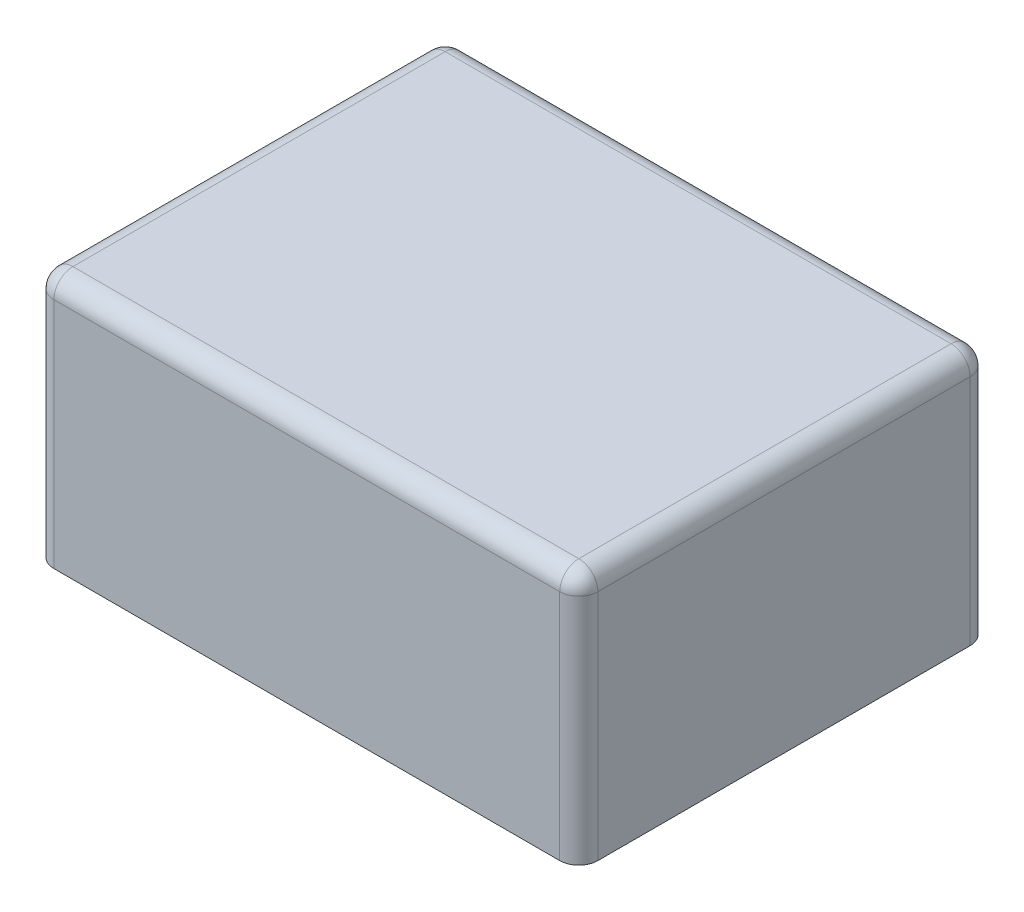
ISO-10303-21;
HEADER;
FILE_DESCRIPTION(('STEP AP214'),'2;1');
FILE_NAME('part.step','',(''),(''),'','','');
FILE_SCHEMA(('AUTOMOTIVE_DESIGN { 1 0 10303 214 1 1 1 1 }'));
ENDSEC;
DATA;
#1=APPLICATION_CONTEXT('core data for automotive mechanical design processes');
#2=APPLICATION_PROTOCOL_DEFINITION('international standard','automotive_design',2000,#1);
#3=PRODUCT_CONTEXT('',#1,'mechanical');
#4=PRODUCT('Part','Part','',(#3));
#5=PRODUCT_RELATED_PRODUCT_CATEGORY('part','',(#4));
#6=PRODUCT_DEFINITION_FORMATION('','',#4);
#7=PRODUCT_DEFINITION_CONTEXT('part definition',#1,'design');
#8=PRODUCT_DEFINITION('design','',#6,#7);
#9=PRODUCT_DEFINITION_SHAPE('','',#8);
#10=(LENGTH_UNIT() NAMED_UNIT(*) SI_UNIT(.MILLI.,.METRE.));
#11=(NAMED_UNIT(*) PLANE_ANGLE_UNIT() SI_UNIT($,.RADIAN.));
#12=(NAMED_UNIT(*) SI_UNIT($,.STERADIAN.) SOLID_ANGLE_UNIT());
#13=UNCERTAINTY_MEASURE_WITH_UNIT(LENGTH_MEASURE(1.E-05),#10,'distance_accuracy_value','');
#14=(GEOMETRIC_REPRESENTATION_CONTEXT(3) GLOBAL_UNCERTAINTY_ASSIGNED_CONTEXT((#13)) GLOBAL_UNIT_ASSIGNED_CONTEXT((#10,
#11,#12)) REPRESENTATION_CONTEXT('',''));
#15=CARTESIAN_POINT('',(0.,0.,0.));
#16=DIRECTION('',(0.,0.,1.));
#17=DIRECTION('',(1.,0.,0.));
#18=AXIS2_PLACEMENT_3D('',#15,#16,#17);
#19=CARTESIAN_POINT('',(1.,13.2,-1.));
#20=DIRECTION('',(0.,-1.,0.));
#21=DIRECTION('',(0.,0.,-1.));
#22=AXIS2_PLACEMENT_3D('',#19,#20,#21);
#23=CYLINDRICAL_SURFACE('',#22,1.);
#24=DIRECTION('',(0.,-1.,0.));
#25=VECTOR('',#24,1.);
#26=CARTESIAN_POINT('',(1.00000000000001,13.2,0.));
#27=LINE('',#26,#25);
#28=CARTESIAN_POINT('',(1.00000000000001,12.2,0.));
#29=VERTEX_POINT('',#28);
#30=CARTESIAN_POINT('',(1.00000000000001,0.,0.));
#31=VERTEX_POINT('',#30);
#32=EDGE_CURVE('E120',#29,#31,#27,.T.);
#33=ORIENTED_EDGE('',*,*,#32,.F.);
#34=CARTESIAN_POINT('',(1.,12.2,-1.));
#35=DIRECTION('',(0.,-1.,0.));
#36=DIRECTION('',(0.,0.,-1.));
#37=AXIS2_PLACEMENT_3D('',#34,#35,#36);
#38=CIRCLE('',#37,1.);
#39=CARTESIAN_POINT('',(0.,12.2,-1.00000000000001));
#40=VERTEX_POINT('',#39);
#41=EDGE_CURVE('E132',#29,#40,#38,.T.);
#42=ORIENTED_EDGE('',*,*,#41,.T.);
#43=DIRECTION('',(0.,-1.,0.));
#44=VECTOR('',#43,1.);
#45=CARTESIAN_POINT('',(0.,13.2,-1.00000000000001));
#46=LINE('',#45,#44);
#47=CARTESIAN_POINT('',(0.,0.,-1.00000000000001));
#48=VERTEX_POINT('',#47);
#49=EDGE_CURVE('E146',#40,#48,#46,.T.);
#50=ORIENTED_EDGE('',*,*,#49,.T.);
#51=CARTESIAN_POINT('',(1.,0.,-1.));
#52=DIRECTION('',(0.,1.,0.));
#53=DIRECTION('',(0.,0.,-1.));
#54=AXIS2_PLACEMENT_3D('',#51,#52,#53);
#55=CIRCLE('',#54,1.);
#56=EDGE_CURVE('E139',#48,#31,#55,.T.);
#57=ORIENTED_EDGE('',*,*,#56,.T.);
#58=EDGE_LOOP('',(#33,#42,#50,#57));
#59=FACE_BOUND('',#58,.T.);
#60=ADVANCED_FACE('F41',(#59),#23,.T.);
#61=CARTESIAN_POINT('',(1.00000000000001,13.2,0.));
#62=DIRECTION('',(0.,0.,-1.));
#63=DIRECTION('',(-1.,0.,0.));
#64=AXIS2_PLACEMENT_3D('',#61,#62,#63);
#65=PLANE('',#64);
#66=DIRECTION('',(0.,-1.,0.));
#67=VECTOR('',#66,1.);
#68=CARTESIAN_POINT('',(27.5,13.2,0.));
#69=LINE('',#68,#67);
#70=CARTESIAN_POINT('',(27.5,12.2,0.));
#71=VERTEX_POINT('',#70);
#72=CARTESIAN_POINT('',(27.5,0.,0.));
#73=VERTEX_POINT('',#72);
#74=EDGE_CURVE('E133',#71,#73,#69,.T.);
#75=ORIENTED_EDGE('',*,*,#74,.F.);
#76=DIRECTION('',(1.,0.,0.));
#77=VECTOR('',#76,1.);
#78=CARTESIAN_POINT('',(1.00000000000001,12.2,0.));
#79=LINE('',#78,#77);
#80=EDGE_CURVE('E11',#71,#29,#79,.F.);
#81=ORIENTED_EDGE('',*,*,#80,.T.);
#82=ORIENTED_EDGE('',*,*,#32,.T.);
#83=DIRECTION('',(1.,0.,0.));
#84=VECTOR('',#83,1.);
#85=CARTESIAN_POINT('',(1.00000000000001,0.,0.));
#86=LINE('',#85,#84);
#87=EDGE_CURVE('E124',#31,#73,#86,.T.);
#88=ORIENTED_EDGE('',*,*,#87,.T.);
#89=EDGE_LOOP('',(#75,#81,#82,#88));
#90=FACE_BOUND('',#89,.T.);
#91=ADVANCED_FACE('F123',(#90),#65,.F.);
#92=CARTESIAN_POINT('',(27.5,13.2,-1.));
#93=DIRECTION('',(0.,-1.,0.));
#94=DIRECTION('',(0.,0.,-1.));
#95=AXIS2_PLACEMENT_3D('',#92,#93,#94);
#96=CYLINDRICAL_SURFACE('',#95,1.);
#97=DIRECTION('',(0.,-1.,0.));
#98=VECTOR('',#97,1.);
#99=CARTESIAN_POINT('',(28.5,13.2,-1.00000000000001));
#100=LINE('',#99,#98);
#101=CARTESIAN_POINT('',(28.5,12.2,-1.00000000000001));
#102=VERTEX_POINT('',#101);
#103=CARTESIAN_POINT('',(28.5,0.,-1.00000000000001));
#104=VERTEX_POINT('',#103);
#105=EDGE_CURVE('E189',#102,#104,#100,.T.);
#106=ORIENTED_EDGE('',*,*,#105,.F.);
#107=CARTESIAN_POINT('',(27.5,12.2,-1.));
#108=DIRECTION('',(0.,-1.,0.));
#109=DIRECTION('',(0.,0.,-1.));
#110=AXIS2_PLACEMENT_3D('',#107,#108,#109);
#111=CIRCLE('',#110,1.);
#112=EDGE_CURVE('E202',#102,#71,#111,.T.);
#113=ORIENTED_EDGE('',*,*,#112,.T.);
#114=ORIENTED_EDGE('',*,*,#74,.T.);
#115=CARTESIAN_POINT('',(27.5,0.,-1.));
#116=DIRECTION('',(0.,1.,0.));
#117=DIRECTION('',(0.,0.,1.));
#118=AXIS2_PLACEMENT_3D('',#115,#116,#117);
#119=CIRCLE('',#118,1.);
#120=EDGE_CURVE('E142',#73,#104,#119,.T.);
#121=ORIENTED_EDGE('',*,*,#120,.T.);
#122=EDGE_LOOP('',(#106,#113,#114,#121));
#123=FACE_BOUND('',#122,.T.);
#124=ADVANCED_FACE('F276',(#123),#96,.T.);
#125=CARTESIAN_POINT('',(28.5,13.2,-1.00000000000001));
#126=DIRECTION('',(-1.,0.,0.));
#127=DIRECTION('',(0.,0.,1.));
#128=AXIS2_PLACEMENT_3D('',#125,#126,#127);
#129=PLANE('',#128);
#130=DIRECTION('',(0.,-1.,0.));
#131=VECTOR('',#130,1.);
#132=CARTESIAN_POINT('',(28.5,13.2,-20.5));
#133=LINE('',#132,#131);
#134=CARTESIAN_POINT('',(28.5,12.2,-20.5));
#135=VERTEX_POINT('',#134);
#136=CARTESIAN_POINT('',(28.5,0.,-20.5));
#137=VERTEX_POINT('',#136);
#138=EDGE_CURVE('E186',#135,#137,#133,.T.);
#139=ORIENTED_EDGE('',*,*,#138,.F.);
#140=DIRECTION('',(0.,0.,-1.));
#141=VECTOR('',#140,1.);
#142=CARTESIAN_POINT('',(28.5,12.2,-1.00000000000001));
#143=LINE('',#142,#141);
#144=EDGE_CURVE('E51',#135,#102,#143,.F.);
#145=ORIENTED_EDGE('',*,*,#144,.T.);
#146=ORIENTED_EDGE('',*,*,#105,.T.);
#147=DIRECTION('',(0.,0.,-1.));
#148=VECTOR('',#147,1.);
#149=CARTESIAN_POINT('',(28.5,0.,-1.00000000000001));
#150=LINE('',#149,#148);
#151=EDGE_CURVE('E156',#104,#137,#150,.T.);
#152=ORIENTED_EDGE('',*,*,#151,.T.);
#153=EDGE_LOOP('',(#139,#145,#146,#152));
#154=FACE_BOUND('',#153,.T.);
#155=ADVANCED_FACE('F279',(#154),#129,.F.);
#156=CARTESIAN_POINT('',(27.5,13.2,-20.5));
#157=DIRECTION('',(0.,-1.,0.));
#158=DIRECTION('',(0.,0.,-1.));
#159=AXIS2_PLACEMENT_3D('',#156,#157,#158);
#160=CYLINDRICAL_SURFACE('',#159,1.);
#161=DIRECTION('',(0.,-1.,0.));
#162=VECTOR('',#161,1.);
#163=CARTESIAN_POINT('',(27.5,13.2,-21.5));
#164=LINE('',#163,#162);
#165=CARTESIAN_POINT('',(27.5,12.2,-21.5));
#166=VERTEX_POINT('',#165);
#167=CARTESIAN_POINT('',(27.5,0.,-21.5));
#168=VERTEX_POINT('',#167);
#169=EDGE_CURVE('E183',#166,#168,#164,.T.);
#170=ORIENTED_EDGE('',*,*,#169,.F.);
#171=CARTESIAN_POINT('',(27.5,12.2,-20.5));
#172=DIRECTION('',(0.,-1.,0.));
#173=DIRECTION('',(0.,0.,-1.));
#174=AXIS2_PLACEMENT_3D('',#171,#172,#173);
#175=CIRCLE('',#174,1.);
#176=EDGE_CURVE('E199',#166,#135,#175,.T.);
#177=ORIENTED_EDGE('',*,*,#176,.T.);
#178=ORIENTED_EDGE('',*,*,#138,.T.);
#179=CARTESIAN_POINT('',(27.5,0.,-20.5));
#180=DIRECTION('',(0.,1.,0.));
#181=DIRECTION('',(0.,0.,1.));
#182=AXIS2_PLACEMENT_3D('',#179,#180,#181);
#183=CIRCLE('',#182,1.);
#184=EDGE_CURVE('E160',#137,#168,#183,.T.);
#185=ORIENTED_EDGE('',*,*,#184,.T.);
#186=EDGE_LOOP('',(#170,#177,#178,#185));
#187=FACE_BOUND('',#186,.T.);
#188=ADVANCED_FACE('F283',(#187),#160,.T.);
#189=CARTESIAN_POINT('',(1.00000000000001,13.2,-21.5));
#190=DIRECTION('',(0.,0.,1.));
#191=DIRECTION('',(1.,0.,0.));
#192=AXIS2_PLACEMENT_3D('',#189,#190,#191);
#193=PLANE('',#192);
#194=DIRECTION('',(0.,-1.,0.));
#195=VECTOR('',#194,1.);
#196=CARTESIAN_POINT('',(1.00000000000001,13.2,-21.5));
#197=LINE('',#196,#195);
#198=CARTESIAN_POINT('',(1.00000000000001,12.2,-21.5));
#199=VERTEX_POINT('',#198);
#200=CARTESIAN_POINT('',(1.00000000000001,0.,-21.5));
#201=VERTEX_POINT('',#200);
#202=EDGE_CURVE('E180',#199,#201,#197,.T.);
#203=ORIENTED_EDGE('',*,*,#202,.F.);
#204=DIRECTION('',(-1.,0.,0.));
#205=VECTOR('',#204,1.);
#206=CARTESIAN_POINT('',(1.00000000000001,12.2,-21.5));
#207=LINE('',#206,#205);
#208=EDGE_CURVE('E218',#199,#166,#207,.F.);
#209=ORIENTED_EDGE('',*,*,#208,.T.);
#210=ORIENTED_EDGE('',*,*,#169,.T.);
#211=DIRECTION('',(-1.,0.,0.));
#212=VECTOR('',#211,1.);
#213=CARTESIAN_POINT('',(1.00000000000001,0.,-21.5));
#214=LINE('',#213,#212);
#215=EDGE_CURVE('E164',#168,#201,#214,.T.);
#216=ORIENTED_EDGE('',*,*,#215,.T.);
#217=EDGE_LOOP('',(#203,#209,#210,#216));
#218=FACE_BOUND('',#217,.T.);
#219=ADVANCED_FACE('F287',(#218),#193,.F.);
#220=CARTESIAN_POINT('',(1.,13.2,-20.5));
#221=DIRECTION('',(0.,-1.,0.));
#222=DIRECTION('',(0.,0.,-1.));
#223=AXIS2_PLACEMENT_3D('',#220,#221,#222);
#224=CYLINDRICAL_SURFACE('',#223,1.);
#225=DIRECTION('',(0.,-1.,0.));
#226=VECTOR('',#225,1.);
#227=CARTESIAN_POINT('',(0.,13.2,-20.5));
#228=LINE('',#227,#226);
#229=CARTESIAN_POINT('',(0.,12.2,-20.5));
#230=VERTEX_POINT('',#229);
#231=CARTESIAN_POINT('',(0.,0.,-20.5));
#232=VERTEX_POINT('',#231);
#233=EDGE_CURVE('E177',#230,#232,#228,.T.);
#234=ORIENTED_EDGE('',*,*,#233,.F.);
#235=CARTESIAN_POINT('',(1.,12.2,-20.5));
#236=DIRECTION('',(0.,-1.,0.));
#237=DIRECTION('',(0.,0.,-1.));
#238=AXIS2_PLACEMENT_3D('',#235,#236,#237);
#239=CIRCLE('',#238,1.);
#240=EDGE_CURVE('E196',#230,#199,#239,.T.);
#241=ORIENTED_EDGE('',*,*,#240,.T.);
#242=ORIENTED_EDGE('',*,*,#202,.T.);
#243=CARTESIAN_POINT('',(1.,0.,-20.5));
#244=DIRECTION('',(0.,1.,0.));
#245=DIRECTION('',(0.,0.,-1.));
#246=AXIS2_PLACEMENT_3D('',#243,#244,#245);
#247=CIRCLE('',#246,1.);
#248=EDGE_CURVE('E168',#201,#232,#247,.T.);
#249=ORIENTED_EDGE('',*,*,#248,.T.);
#250=EDGE_LOOP('',(#234,#241,#242,#249));
#251=FACE_BOUND('',#250,.T.);
#252=ADVANCED_FACE('F291',(#251),#224,.T.);
#253=CARTESIAN_POINT('',(0.,13.2,-1.00000000000001));
#254=DIRECTION('',(1.,0.,0.));
#255=DIRECTION('',(0.,0.,-1.));
#256=AXIS2_PLACEMENT_3D('',#253,#254,#255);
#257=PLANE('',#256);
#258=ORIENTED_EDGE('',*,*,#49,.F.);
#259=DIRECTION('',(0.,0.,1.));
#260=VECTOR('',#259,1.);
#261=CARTESIAN_POINT('',(0.,12.2,-1.00000000000001));
#262=LINE('',#261,#260);
#263=EDGE_CURVE('E215',#40,#230,#262,.F.);
#264=ORIENTED_EDGE('',*,*,#263,.T.);
#265=ORIENTED_EDGE('',*,*,#233,.T.);
#266=DIRECTION('',(0.,0.,1.));
#267=VECTOR('',#266,1.);
#268=CARTESIAN_POINT('',(0.,0.,-1.00000000000001));
#269=LINE('',#268,#267);
#270=EDGE_CURVE('E172',#232,#48,#269,.T.);
#271=ORIENTED_EDGE('',*,*,#270,.T.);
#272=EDGE_LOOP('',(#258,#264,#265,#271));
#273=FACE_BOUND('',#272,.T.);
#274=ADVANCED_FACE('F293',(#273),#257,.F.);
#275=CARTESIAN_POINT('',(1.,13.2,-1.));
#276=DIRECTION('',(0.,-1.,0.));
#277=DIRECTION('',(0.,0.,-1.));
#278=AXIS2_PLACEMENT_3D('',#275,#276,#277);
#279=PLANE('',#278);
#280=DIRECTION('',(-1.,0.,0.));
#281=VECTOR('',#280,1.);
#282=CARTESIAN_POINT('',(1.,13.2,-20.5));
#283=LINE('',#282,#281);
#284=CARTESIAN_POINT('',(27.5,13.2,-20.5));
#285=VERTEX_POINT('',#284);
#286=CARTESIAN_POINT('',(1.,13.2,-20.5));
#287=VERTEX_POINT('',#286);
#288=EDGE_CURVE('E59',#285,#287,#283,.T.);
#289=ORIENTED_EDGE('',*,*,#288,.T.);
#290=DIRECTION('',(0.,0.,1.));
#291=VECTOR('',#290,1.);
#292=CARTESIAN_POINT('',(1.,13.2,-1.));
#293=LINE('',#292,#291);
#294=CARTESIAN_POINT('',(1.,13.2,-1.));
#295=VERTEX_POINT('',#294);
#296=EDGE_CURVE('E212',#287,#295,#293,.T.);
#297=ORIENTED_EDGE('',*,*,#296,.T.);
#298=DIRECTION('',(1.,0.,0.));
#299=VECTOR('',#298,1.);
#300=CARTESIAN_POINT('',(1.,13.2,-1.));
#301=LINE('',#300,#299);
#302=CARTESIAN_POINT('',(27.5,13.2,-1.));
#303=VERTEX_POINT('',#302);
#304=EDGE_CURVE('E205',#295,#303,#301,.T.);
#305=ORIENTED_EDGE('',*,*,#304,.T.);
#306=DIRECTION('',(0.,0.,-1.));
#307=VECTOR('',#306,1.);
#308=CARTESIAN_POINT('',(27.5,13.2,-1.));
#309=LINE('',#308,#307);
#310=EDGE_CURVE('E64',#303,#285,#309,.T.);
#311=ORIENTED_EDGE('',*,*,#310,.T.);
#312=EDGE_LOOP('',(#289,#297,#305,#311));
#313=FACE_BOUND('',#312,.T.);
#314=ADVANCED_FACE('F266',(#313),#279,.F.);
#315=CARTESIAN_POINT('',(1.,0.,-1.));
#316=DIRECTION('',(0.,-1.,0.));
#317=DIRECTION('',(0.,0.,-1.));
#318=AXIS2_PLACEMENT_3D('',#315,#316,#317);
#319=PLANE('',#318);
#320=ORIENTED_EDGE('',*,*,#56,.F.);
#321=ORIENTED_EDGE('',*,*,#270,.F.);
#322=ORIENTED_EDGE('',*,*,#248,.F.);
#323=ORIENTED_EDGE('',*,*,#215,.F.);
#324=ORIENTED_EDGE('',*,*,#184,.F.);
#325=ORIENTED_EDGE('',*,*,#151,.F.);
#326=ORIENTED_EDGE('',*,*,#120,.F.);
#327=ORIENTED_EDGE('',*,*,#87,.F.);
#328=EDGE_LOOP('',(#320,#321,#322,#323,#324,#325,#326,#327));
#329=FACE_BOUND('',#328,.T.);
#330=ADVANCED_FACE('F137',(#329),#319,.T.);
#331=CARTESIAN_POINT('',(27.5,12.2,-20.5));
#332=DIRECTION('',(0.,-1.,0.));
#333=DIRECTION('',(0.,0.,-1.));
#334=AXIS2_PLACEMENT_3D('',#331,#332,#333);
#335=SPHERICAL_SURFACE('',#334,1.);
#336=CARTESIAN_POINT('',(27.5,12.2,-20.5));
#337=DIRECTION('',(0.,0.,1.));
#338=DIRECTION('',(1.,0.,0.));
#339=AXIS2_PLACEMENT_3D('',#336,#337,#338);
#340=CIRCLE('',#339,1.);
#341=EDGE_CURVE('E152',#135,#285,#340,.T.);
#342=ORIENTED_EDGE('',*,*,#341,.F.);
#343=ORIENTED_EDGE('',*,*,#176,.F.);
#344=CARTESIAN_POINT('',(27.5,12.2,-20.5));
#345=DIRECTION('',(-1.,0.,0.));
#346=DIRECTION('',(0.,0.,1.));
#347=AXIS2_PLACEMENT_3D('',#344,#345,#346);
#348=CIRCLE('',#347,1.);
#349=EDGE_CURVE('E45',#285,#166,#348,.T.);
#350=ORIENTED_EDGE('',*,*,#349,.F.);
#351=EDGE_LOOP('',(#342,#343,#350));
#352=FACE_BOUND('',#351,.T.);
#353=ADVANCED_FACE('F43',(#352),#335,.T.);
#354=CARTESIAN_POINT('',(1.,12.2,-20.5));
#355=DIRECTION('',(-1.,0.,0.));
#356=DIRECTION('',(0.,0.,1.));
#357=AXIS2_PLACEMENT_3D('',#354,#355,#356);
#358=CYLINDRICAL_SURFACE('',#357,1.);
#359=ORIENTED_EDGE('',*,*,#349,.T.);
#360=ORIENTED_EDGE('',*,*,#208,.F.);
#361=CARTESIAN_POINT('',(1.,12.2,-20.5));
#362=DIRECTION('',(-1.,0.,0.));
#363=DIRECTION('',(0.,0.,1.));
#364=AXIS2_PLACEMENT_3D('',#361,#362,#363);
#365=CIRCLE('',#364,1.);
#366=EDGE_CURVE('E241',#287,#199,#365,.T.);
#367=ORIENTED_EDGE('',*,*,#366,.F.);
#368=ORIENTED_EDGE('',*,*,#288,.F.);
#369=EDGE_LOOP('',(#359,#360,#367,#368));
#370=FACE_BOUND('',#369,.T.);
#371=ADVANCED_FACE('F255',(#370),#358,.T.);
#372=CARTESIAN_POINT('',(27.5,12.2,-1.));
#373=DIRECTION('',(0.,0.,-1.));
#374=DIRECTION('',(-1.,0.,0.));
#375=AXIS2_PLACEMENT_3D('',#372,#373,#374);
#376=CYLINDRICAL_SURFACE('',#375,1.);
#377=ORIENTED_EDGE('',*,*,#341,.T.);
#378=ORIENTED_EDGE('',*,*,#310,.F.);
#379=CARTESIAN_POINT('',(27.5,12.2,-1.00000000000001));
#380=DIRECTION('',(0.,0.,1.));
#381=DIRECTION('',(0.,-1.,0.));
#382=AXIS2_PLACEMENT_3D('',#379,#380,#381);
#383=CIRCLE('',#382,1.);
#384=EDGE_CURVE('E237',#102,#303,#383,.T.);
#385=ORIENTED_EDGE('',*,*,#384,.F.);
#386=ORIENTED_EDGE('',*,*,#144,.F.);
#387=EDGE_LOOP('',(#377,#378,#385,#386));
#388=FACE_BOUND('',#387,.T.);
#389=ADVANCED_FACE('F249',(#388),#376,.T.);
#390=CARTESIAN_POINT('',(1.,12.2,-20.5));
#391=DIRECTION('',(0.,-1.,0.));
#392=DIRECTION('',(0.,0.,-1.));
#393=AXIS2_PLACEMENT_3D('',#390,#391,#392);
#394=SPHERICAL_SURFACE('',#393,1.);
#395=ORIENTED_EDGE('',*,*,#366,.T.);
#396=ORIENTED_EDGE('',*,*,#240,.F.);
#397=CARTESIAN_POINT('',(1.,12.2,-20.5));
#398=DIRECTION('',(0.,0.,1.));
#399=DIRECTION('',(1.,0.,0.));
#400=AXIS2_PLACEMENT_3D('',#397,#398,#399);
#401=CIRCLE('',#400,1.);
#402=EDGE_CURVE('E233',#287,#230,#401,.T.);
#403=ORIENTED_EDGE('',*,*,#402,.F.);
#404=EDGE_LOOP('',(#395,#396,#403));
#405=FACE_BOUND('',#404,.T.);
#406=ADVANCED_FACE('F260',(#405),#394,.T.);
#407=CARTESIAN_POINT('',(27.5,12.2,-1.));
#408=DIRECTION('',(0.,-1.,0.));
#409=DIRECTION('',(0.,0.,-1.));
#410=AXIS2_PLACEMENT_3D('',#407,#408,#409);
#411=SPHERICAL_SURFACE('',#410,1.);
#412=ORIENTED_EDGE('',*,*,#112,.F.);
#413=ORIENTED_EDGE('',*,*,#384,.T.);
#414=CARTESIAN_POINT('',(27.5,12.2,-0.999999999999999));
#415=DIRECTION('',(-1.,0.,0.));
#416=DIRECTION('',(0.,0.,1.));
#417=AXIS2_PLACEMENT_3D('',#414,#415,#416);
#418=CIRCLE('',#417,1.);
#419=EDGE_CURVE('E229',#71,#303,#418,.T.);
#420=ORIENTED_EDGE('',*,*,#419,.F.);
#421=EDGE_LOOP('',(#412,#413,#420));
#422=FACE_BOUND('',#421,.T.);
#423=ADVANCED_FACE('F273',(#422),#411,.T.);
#424=CARTESIAN_POINT('',(1.,12.2,-1.));
#425=DIRECTION('',(0.,0.,1.));
#426=DIRECTION('',(1.,0.,0.));
#427=AXIS2_PLACEMENT_3D('',#424,#425,#426);
#428=CYLINDRICAL_SURFACE('',#427,1.);
#429=ORIENTED_EDGE('',*,*,#402,.T.);
#430=ORIENTED_EDGE('',*,*,#263,.F.);
#431=CARTESIAN_POINT('',(1.,12.2,-1.));
#432=DIRECTION('',(0.,0.,1.));
#433=DIRECTION('',(1.,0.,0.));
#434=AXIS2_PLACEMENT_3D('',#431,#432,#433);
#435=CIRCLE('',#434,1.);
#436=EDGE_CURVE('E226',#295,#40,#435,.T.);
#437=ORIENTED_EDGE('',*,*,#436,.F.);
#438=ORIENTED_EDGE('',*,*,#296,.F.);
#439=EDGE_LOOP('',(#429,#430,#437,#438));
#440=FACE_BOUND('',#439,.T.);
#441=ADVANCED_FACE('F264',(#440),#428,.T.);
#442=CARTESIAN_POINT('',(1.,12.2,-1.));
#443=DIRECTION('',(1.,0.,0.));
#444=DIRECTION('',(0.,0.,-1.));
#445=AXIS2_PLACEMENT_3D('',#442,#443,#444);
#446=CYLINDRICAL_SURFACE('',#445,1.);
#447=ORIENTED_EDGE('',*,*,#419,.T.);
#448=ORIENTED_EDGE('',*,*,#304,.F.);
#449=CARTESIAN_POINT('',(1.00000000000001,12.2,-1.));
#450=DIRECTION('',(-1.,0.,0.));
#451=DIRECTION('',(0.,-1.,0.));
#452=AXIS2_PLACEMENT_3D('',#449,#450,#451);
#453=CIRCLE('',#452,1.);
#454=EDGE_CURVE('E223',#29,#295,#453,.T.);
#455=ORIENTED_EDGE('',*,*,#454,.F.);
#456=ORIENTED_EDGE('',*,*,#80,.F.);
#457=EDGE_LOOP('',(#447,#448,#455,#456));
#458=FACE_BOUND('',#457,.T.);
#459=ADVANCED_FACE('F269',(#458),#446,.T.);
#460=CARTESIAN_POINT('',(1.,12.2,-1.));
#461=DIRECTION('',(0.,-1.,0.));
#462=DIRECTION('',(0.,0.,-1.));
#463=AXIS2_PLACEMENT_3D('',#460,#461,#462);
#464=SPHERICAL_SURFACE('',#463,1.);
#465=ORIENTED_EDGE('',*,*,#436,.T.);
#466=ORIENTED_EDGE('',*,*,#41,.F.);
#467=ORIENTED_EDGE('',*,*,#454,.T.);
#468=EDGE_LOOP('',(#465,#466,#467));
#469=FACE_BOUND('',#468,.T.);
#470=ADVANCED_FACE('F295',(#469),#464,.T.);
#471=CLOSED_SHELL('',(#60,#91,#124,#155,#188,#219,#252,#274,#314,#330,#353,#371,#389,#406,#423,
#441,#459,#470));
#472=MANIFOLD_SOLID_BREP('B2',#471);
#473=ADVANCED_BREP_SHAPE_REPRESENTATION('',(#18,#472),#14);
#474=SHAPE_DEFINITION_REPRESENTATION(#9,#473);
ENDSEC;
END-ISO-10303-21;
